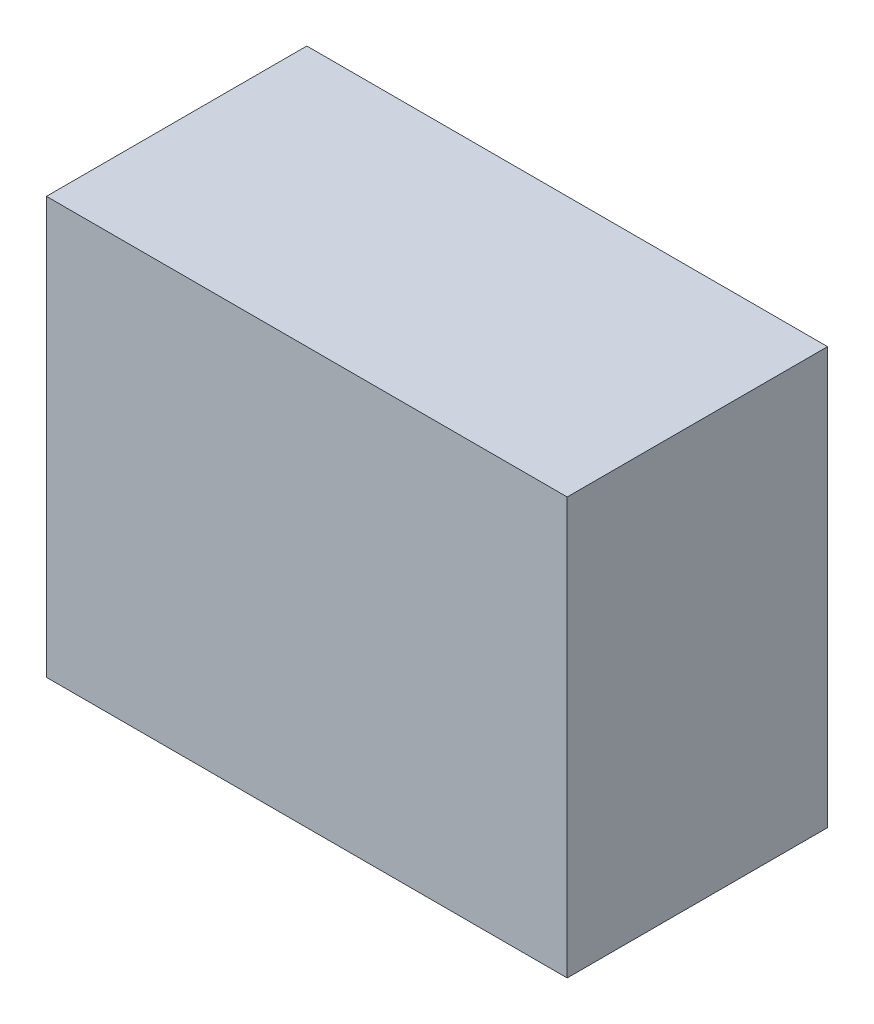
ISO-10303-21;
HEADER;
FILE_DESCRIPTION(('STEP AP214'),'2;1');
FILE_NAME('part.step','',(''),(''),'','','');
FILE_SCHEMA(('AUTOMOTIVE_DESIGN { 1 0 10303 214 1 1 1 1 }'));
ENDSEC;
DATA;
#1=APPLICATION_CONTEXT('core data for automotive mechanical design processes');
#2=APPLICATION_PROTOCOL_DEFINITION('international standard','automotive_design',2000,#1);
#3=PRODUCT_CONTEXT('',#1,'mechanical');
#4=PRODUCT('Part','Part','',(#3));
#5=PRODUCT_RELATED_PRODUCT_CATEGORY('part','',(#4));
#6=PRODUCT_DEFINITION_FORMATION('','',#4);
#7=PRODUCT_DEFINITION_CONTEXT('part definition',#1,'design');
#8=PRODUCT_DEFINITION('design','',#6,#7);
#9=PRODUCT_DEFINITION_SHAPE('','',#8);
#10=(LENGTH_UNIT() NAMED_UNIT(*) SI_UNIT(.MILLI.,.METRE.));
#11=(NAMED_UNIT(*) PLANE_ANGLE_UNIT() SI_UNIT($,.RADIAN.));
#12=(NAMED_UNIT(*) SI_UNIT($,.STERADIAN.) SOLID_ANGLE_UNIT());
#13=UNCERTAINTY_MEASURE_WITH_UNIT(LENGTH_MEASURE(1.E-05),#10,'distance_accuracy_value','');
#14=(GEOMETRIC_REPRESENTATION_CONTEXT(3) GLOBAL_UNCERTAINTY_ASSIGNED_CONTEXT((#13)) GLOBAL_UNIT_ASSIGNED_CONTEXT((#10,
#11,#12)) REPRESENTATION_CONTEXT('',''));
#15=CARTESIAN_POINT('',(0.,0.,0.));
#16=DIRECTION('',(0.,0.,1.));
#17=DIRECTION('',(1.,0.,0.));
#18=AXIS2_PLACEMENT_3D('',#15,#16,#17);
#19=CARTESIAN_POINT('',(0.499999,0.3999992,0.499999));
#20=DIRECTION('',(0.,0.,-1.));
#21=DIRECTION('',(-1.,0.,0.));
#22=AXIS2_PLACEMENT_3D('',#19,#20,#21);
#23=PLANE('',#22);
#24=DIRECTION('',(0.,1.,0.));
#25=VECTOR('',#24,1.);
#26=CARTESIAN_POINT('',(-0.499999,0.3999992,0.499999));
#27=LINE('',#26,#25);
#28=CARTESIAN_POINT('',(-0.499999,0.3999992,0.499999));
#29=VERTEX_POINT('',#28);
#30=CARTESIAN_POINT('',(-0.499999,-0.3999992,0.499999));
#31=VERTEX_POINT('',#30);
#32=EDGE_CURVE('E54',#29,#31,#27,.F.);
#33=ORIENTED_EDGE('',*,*,#32,.T.);
#34=DIRECTION('',(1.,0.,0.));
#35=VECTOR('',#34,1.);
#36=CARTESIAN_POINT('',(-0.499999,-0.3999992,0.499999));
#37=LINE('',#36,#35);
#38=CARTESIAN_POINT('',(0.499999,-0.3999992,0.499999));
#39=VERTEX_POINT('',#38);
#40=EDGE_CURVE('E56',#31,#39,#37,.T.);
#41=ORIENTED_EDGE('',*,*,#40,.T.);
#42=DIRECTION('',(0.,1.,0.));
#43=VECTOR('',#42,1.);
#44=CARTESIAN_POINT('',(0.499999,-0.3999992,0.499999));
#45=LINE('',#44,#43);
#46=CARTESIAN_POINT('',(0.499999,0.3999992,0.499999));
#47=VERTEX_POINT('',#46);
#48=EDGE_CURVE('E19',#39,#47,#45,.T.);
#49=ORIENTED_EDGE('',*,*,#48,.T.);
#50=DIRECTION('',(1.,0.,0.));
#51=VECTOR('',#50,1.);
#52=CARTESIAN_POINT('',(0.499999,0.3999992,0.499999));
#53=LINE('',#52,#51);
#54=EDGE_CURVE('E79',#47,#29,#53,.F.);
#55=ORIENTED_EDGE('',*,*,#54,.T.);
#56=EDGE_LOOP('',(#33,#41,#49,#55));
#57=FACE_BOUND('',#56,.T.);
#58=ADVANCED_FACE('F16',(#57),#23,.F.);
#59=CARTESIAN_POINT('',(0.499999,-0.3999992,0.));
#60=DIRECTION('',(-1.,0.,0.));
#61=DIRECTION('',(0.,0.,1.));
#62=AXIS2_PLACEMENT_3D('',#59,#60,#61);
#63=PLANE('',#62);
#64=DIRECTION('',(0.,0.,-1.));
#65=VECTOR('',#64,1.);
#66=CARTESIAN_POINT('',(0.499999,0.3999992,0.));
#67=LINE('',#66,#65);
#68=CARTESIAN_POINT('',(0.499999,0.3999992,0.));
#69=VERTEX_POINT('',#68);
#70=EDGE_CURVE('E67',#69,#47,#67,.F.);
#71=ORIENTED_EDGE('',*,*,#70,.T.);
#72=ORIENTED_EDGE('',*,*,#48,.F.);
#73=DIRECTION('',(0.,0.,1.));
#74=VECTOR('',#73,1.);
#75=CARTESIAN_POINT('',(0.499999,-0.3999992,0.));
#76=LINE('',#75,#74);
#77=CARTESIAN_POINT('',(0.499999,-0.3999992,0.));
#78=VERTEX_POINT('',#77);
#79=EDGE_CURVE('E62',#39,#78,#76,.F.);
#80=ORIENTED_EDGE('',*,*,#79,.T.);
#81=DIRECTION('',(0.,1.,0.));
#82=VECTOR('',#81,1.);
#83=CARTESIAN_POINT('',(0.499999,0.3999992,0.));
#84=LINE('',#83,#82);
#85=EDGE_CURVE('E82',#69,#78,#84,.F.);
#86=ORIENTED_EDGE('',*,*,#85,.F.);
#87=EDGE_LOOP('',(#71,#72,#80,#86));
#88=FACE_BOUND('',#87,.T.);
#89=ADVANCED_FACE('F64',(#88),#63,.F.);
#90=CARTESIAN_POINT('',(-0.499999,-0.3999992,0.));
#91=DIRECTION('',(0.,1.,0.));
#92=DIRECTION('',(0.,0.,1.));
#93=AXIS2_PLACEMENT_3D('',#90,#91,#92);
#94=PLANE('',#93);
#95=ORIENTED_EDGE('',*,*,#79,.F.);
#96=ORIENTED_EDGE('',*,*,#40,.F.);
#97=DIRECTION('',(0.,0.,-1.));
#98=VECTOR('',#97,1.);
#99=CARTESIAN_POINT('',(-0.499999,-0.3999992,0.));
#100=LINE('',#99,#98);
#101=CARTESIAN_POINT('',(-0.499999,-0.3999992,0.));
#102=VERTEX_POINT('',#101);
#103=EDGE_CURVE('E74',#31,#102,#100,.T.);
#104=ORIENTED_EDGE('',*,*,#103,.T.);
#105=DIRECTION('',(-1.,0.,0.));
#106=VECTOR('',#105,1.);
#107=CARTESIAN_POINT('',(0.499999,-0.3999992,0.));
#108=LINE('',#107,#106);
#109=EDGE_CURVE('E71',#78,#102,#108,.T.);
#110=ORIENTED_EDGE('',*,*,#109,.F.);
#111=EDGE_LOOP('',(#95,#96,#104,#110));
#112=FACE_BOUND('',#111,.T.);
#113=ADVANCED_FACE('F69',(#112),#94,.F.);
#114=CARTESIAN_POINT('',(-0.499999,0.3999992,0.));
#115=DIRECTION('',(1.,0.,0.));
#116=DIRECTION('',(0.,0.,-1.));
#117=AXIS2_PLACEMENT_3D('',#114,#115,#116);
#118=PLANE('',#117);
#119=ORIENTED_EDGE('',*,*,#103,.F.);
#120=ORIENTED_EDGE('',*,*,#32,.F.);
#121=DIRECTION('',(0.,0.,-1.));
#122=VECTOR('',#121,1.);
#123=CARTESIAN_POINT('',(-0.499999,0.3999992,0.));
#124=LINE('',#123,#122);
#125=CARTESIAN_POINT('',(-0.499999,0.3999992,0.));
#126=VERTEX_POINT('',#125);
#127=EDGE_CURVE('E34',#29,#126,#124,.T.);
#128=ORIENTED_EDGE('',*,*,#127,.T.);
#129=DIRECTION('',(0.,1.,0.));
#130=VECTOR('',#129,1.);
#131=CARTESIAN_POINT('',(-0.499999,0.3999992,0.));
#132=LINE('',#131,#130);
#133=EDGE_CURVE('E25',#102,#126,#132,.T.);
#134=ORIENTED_EDGE('',*,*,#133,.F.);
#135=EDGE_LOOP('',(#119,#120,#128,#134));
#136=FACE_BOUND('',#135,.T.);
#137=ADVANCED_FACE('F88',(#136),#118,.F.);
#138=CARTESIAN_POINT('',(0.499999,0.3999992,0.));
#139=DIRECTION('',(0.,-1.,0.));
#140=DIRECTION('',(0.,0.,-1.));
#141=AXIS2_PLACEMENT_3D('',#138,#139,#140);
#142=PLANE('',#141);
#143=ORIENTED_EDGE('',*,*,#127,.F.);
#144=ORIENTED_EDGE('',*,*,#54,.F.);
#145=ORIENTED_EDGE('',*,*,#70,.F.);
#146=DIRECTION('',(-1.,0.,0.));
#147=VECTOR('',#146,1.);
#148=CARTESIAN_POINT('',(0.499999,0.3999992,0.));
#149=LINE('',#148,#147);
#150=EDGE_CURVE('E11',#126,#69,#149,.F.);
#151=ORIENTED_EDGE('',*,*,#150,.F.);
#152=EDGE_LOOP('',(#143,#144,#145,#151));
#153=FACE_BOUND('',#152,.T.);
#154=ADVANCED_FACE('F90',(#153),#142,.F.);
#155=CARTESIAN_POINT('',(0.499999,0.3999992,0.));
#156=DIRECTION('',(0.,0.,-1.));
#157=DIRECTION('',(-1.,0.,0.));
#158=AXIS2_PLACEMENT_3D('',#155,#156,#157);
#159=PLANE('',#158);
#160=ORIENTED_EDGE('',*,*,#133,.T.);
#161=ORIENTED_EDGE('',*,*,#150,.T.);
#162=ORIENTED_EDGE('',*,*,#85,.T.);
#163=ORIENTED_EDGE('',*,*,#109,.T.);
#164=EDGE_LOOP('',(#160,#161,#162,#163));
#165=FACE_BOUND('',#164,.T.);
#166=ADVANCED_FACE('F87',(#165),#159,.T.);
#167=CLOSED_SHELL('',(#58,#89,#113,#137,#154,#166));
#168=MANIFOLD_SOLID_BREP('B1',#167);
#169=ADVANCED_BREP_SHAPE_REPRESENTATION('',(#18,#168),#14);
#170=SHAPE_DEFINITION_REPRESENTATION(#9,#169);
ENDSEC;
END-ISO-10303-21;
